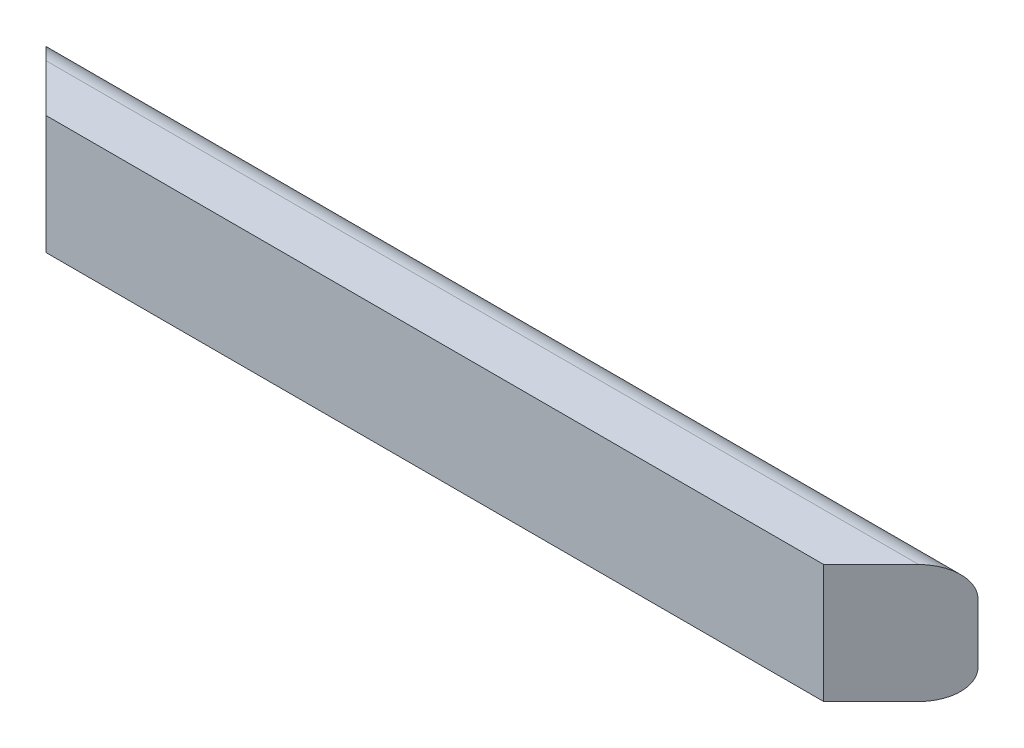
ISO-10303-21;
HEADER;
FILE_DESCRIPTION(('STEP AP214'),'2;1');
FILE_NAME('part.step','',(''),(''),'','','');
FILE_SCHEMA(('AUTOMOTIVE_DESIGN { 1 0 10303 214 1 1 1 1 }'));
ENDSEC;
DATA;
#1=APPLICATION_CONTEXT('core data for automotive mechanical design processes');
#2=APPLICATION_PROTOCOL_DEFINITION('international standard','automotive_design',2000,#1);
#3=PRODUCT_CONTEXT('',#1,'mechanical');
#4=PRODUCT('Part','Part','',(#3));
#5=PRODUCT_RELATED_PRODUCT_CATEGORY('part','',(#4));
#6=PRODUCT_DEFINITION_FORMATION('','',#4);
#7=PRODUCT_DEFINITION_CONTEXT('part definition',#1,'design');
#8=PRODUCT_DEFINITION('design','',#6,#7);
#9=PRODUCT_DEFINITION_SHAPE('','',#8);
#10=(LENGTH_UNIT() NAMED_UNIT(*) SI_UNIT(.MILLI.,.METRE.));
#11=(NAMED_UNIT(*) PLANE_ANGLE_UNIT() SI_UNIT($,.RADIAN.));
#12=(NAMED_UNIT(*) SI_UNIT($,.STERADIAN.) SOLID_ANGLE_UNIT());
#13=UNCERTAINTY_MEASURE_WITH_UNIT(LENGTH_MEASURE(1.E-05),#10,'distance_accuracy_value','');
#14=(GEOMETRIC_REPRESENTATION_CONTEXT(3) GLOBAL_UNCERTAINTY_ASSIGNED_CONTEXT((#13)) GLOBAL_UNIT_ASSIGNED_CONTEXT((#10,
#11,#12)) REPRESENTATION_CONTEXT('',''));
#15=CARTESIAN_POINT('',(0.,0.,0.));
#16=DIRECTION('',(0.,0.,1.));
#17=DIRECTION('',(1.,0.,0.));
#18=AXIS2_PLACEMENT_3D('',#15,#16,#17);
#19=CARTESIAN_POINT('',(996.95,0.,0.));
#20=DIRECTION('',(0.,1.,0.));
#21=DIRECTION('',(0.,0.,1.));
#22=AXIS2_PLACEMENT_3D('',#19,#20,#21);
#23=PLANE('',#22);
#24=DIRECTION('',(-1.,0.,0.));
#25=VECTOR('',#24,1.);
#26=CARTESIAN_POINT('',(996.95,0.,19.05));
#27=LINE('',#26,#25);
#28=CARTESIAN_POINT('',(914.4,0.,19.05));
#29=VERTEX_POINT('',#28);
#30=CARTESIAN_POINT('',(82.5499999999999,0.,19.05));
#31=VERTEX_POINT('',#30);
#32=EDGE_CURVE('E110',#29,#31,#27,.T.);
#33=ORIENTED_EDGE('',*,*,#32,.T.);
#34=DIRECTION('',(-0.707106781186549,0.,-0.707106781186546));
#35=VECTOR('',#34,1.);
#36=CARTESIAN_POINT('',(530.225000000001,0.,466.725));
#37=LINE('',#36,#35);
#38=CARTESIAN_POINT('',(31.7499999999996,0.,-31.7500000000001));
#39=VERTEX_POINT('',#38);
#40=EDGE_CURVE('E98',#31,#39,#37,.T.);
#41=ORIENTED_EDGE('',*,*,#40,.T.);
#42=DIRECTION('',(-1.,0.,0.));
#43=VECTOR('',#42,1.);
#44=CARTESIAN_POINT('',(996.95,0.,-31.75));
#45=LINE('',#44,#43);
#46=CARTESIAN_POINT('',(965.2,0.,-31.75));
#47=VERTEX_POINT('',#46);
#48=EDGE_CURVE('E11',#47,#39,#45,.T.);
#49=ORIENTED_EDGE('',*,*,#48,.F.);
#50=DIRECTION('',(-0.707106781186549,0.,0.707106781186546));
#51=VECTOR('',#50,1.);
#52=CARTESIAN_POINT('',(965.2,0.,-31.7499999999999));
#53=LINE('',#52,#51);
#54=EDGE_CURVE('E115',#47,#29,#53,.T.);
#55=ORIENTED_EDGE('',*,*,#54,.T.);
#56=EDGE_LOOP('',(#33,#41,#49,#55));
#57=FACE_BOUND('',#56,.T.);
#58=ADVANCED_FACE('F33',(#57),#23,.F.);
#59=CARTESIAN_POINT('',(996.95,31.75,-31.75));
#60=DIRECTION('',(-1.,0.,0.));
#61=DIRECTION('',(0.,0.,1.));
#62=AXIS2_PLACEMENT_3D('',#59,#60,#61);
#63=CYLINDRICAL_SURFACE('',#62,31.75);
#64=ORIENTED_EDGE('',*,*,#48,.T.);
#65=CARTESIAN_POINT('',(31.7499999999997,31.75,-31.75));
#66=DIRECTION('',(0.707106781186546,0.,-0.707106781186549));
#67=DIRECTION('',(-0.707106781186549,0.,-0.707106781186546));
#68=AXIS2_PLACEMENT_3D('',#65,#66,#67);
#69=ELLIPSE('',#68,44.9012806053458,31.75);
#70=CARTESIAN_POINT('',(0.,31.75,-63.4999999999996));
#71=VERTEX_POINT('',#70);
#72=EDGE_CURVE('E83',#39,#71,#69,.T.);
#73=ORIENTED_EDGE('',*,*,#72,.T.);
#74=DIRECTION('',(-1.,0.,0.));
#75=VECTOR('',#74,1.);
#76=CARTESIAN_POINT('',(996.95,31.75,-63.5));
#77=LINE('',#76,#75);
#78=CARTESIAN_POINT('',(996.95,31.75,-63.5));
#79=VERTEX_POINT('',#78);
#80=EDGE_CURVE('E41',#79,#71,#77,.T.);
#81=ORIENTED_EDGE('',*,*,#80,.F.);
#82=CARTESIAN_POINT('',(965.2,31.75,-31.75));
#83=DIRECTION('',(-0.707106781186546,0.,-0.707106781186549));
#84=DIRECTION('',(-0.707106781186549,0.,0.707106781186546));
#85=AXIS2_PLACEMENT_3D('',#82,#83,#84);
#86=ELLIPSE('',#85,44.9012806053458,31.75);
#87=EDGE_CURVE('E47',#79,#47,#86,.T.);
#88=ORIENTED_EDGE('',*,*,#87,.T.);
#89=EDGE_LOOP('',(#64,#73,#81,#88));
#90=FACE_BOUND('',#89,.T.);
#91=ADVANCED_FACE('F94',(#90),#63,.T.);
#92=CARTESIAN_POINT('',(996.95,95.25,-63.5));
#93=DIRECTION('',(0.,0.,1.));
#94=DIRECTION('',(1.,0.,0.));
#95=AXIS2_PLACEMENT_3D('',#92,#93,#94);
#96=PLANE('',#95);
#97=DIRECTION('',(0.,1.,0.));
#98=VECTOR('',#97,1.);
#99=CARTESIAN_POINT('',(0.,95.25,-63.5));
#100=LINE('',#99,#98);
#101=CARTESIAN_POINT('',(0.,95.25,-63.5));
#102=VERTEX_POINT('',#101);
#103=EDGE_CURVE('E80',#71,#102,#100,.T.);
#104=ORIENTED_EDGE('',*,*,#103,.T.);
#105=DIRECTION('',(-1.,0.,0.));
#106=VECTOR('',#105,1.);
#107=CARTESIAN_POINT('',(996.95,95.25,-63.5));
#108=LINE('',#107,#106);
#109=CARTESIAN_POINT('',(996.95,95.25,-63.4999999999996));
#110=VERTEX_POINT('',#109);
#111=EDGE_CURVE('E101',#110,#102,#108,.T.);
#112=ORIENTED_EDGE('',*,*,#111,.F.);
#113=DIRECTION('',(0.,1.,0.));
#114=VECTOR('',#113,1.);
#115=CARTESIAN_POINT('',(996.95,95.25,-63.5));
#116=LINE('',#115,#114);
#117=EDGE_CURVE('E91',#79,#110,#116,.T.);
#118=ORIENTED_EDGE('',*,*,#117,.F.);
#119=ORIENTED_EDGE('',*,*,#80,.T.);
#120=EDGE_LOOP('',(#104,#112,#118,#119));
#121=FACE_BOUND('',#120,.T.);
#122=ADVANCED_FACE('F100',(#121),#96,.F.);
#123=CARTESIAN_POINT('',(996.95,95.25,-31.75));
#124=DIRECTION('',(-1.,0.,0.));
#125=DIRECTION('',(0.,0.,1.));
#126=AXIS2_PLACEMENT_3D('',#123,#124,#125);
#127=CYLINDRICAL_SURFACE('',#126,31.75);
#128=ORIENTED_EDGE('',*,*,#111,.T.);
#129=CARTESIAN_POINT('',(31.7499999999997,95.25,-31.75));
#130=DIRECTION('',(0.707106781186546,0.,-0.707106781186549));
#131=DIRECTION('',(-0.707106781186549,0.,-0.707106781186546));
#132=AXIS2_PLACEMENT_3D('',#129,#130,#131);
#133=ELLIPSE('',#132,44.9012806053458,31.75);
#134=CARTESIAN_POINT('',(31.7499999999997,127.,-31.75));
#135=VERTEX_POINT('',#134);
#136=EDGE_CURVE('E86',#102,#135,#133,.T.);
#137=ORIENTED_EDGE('',*,*,#136,.T.);
#138=DIRECTION('',(-1.,0.,0.));
#139=VECTOR('',#138,1.);
#140=CARTESIAN_POINT('',(996.95,127.,-31.75));
#141=LINE('',#140,#139);
#142=CARTESIAN_POINT('',(965.2,127.,-31.75));
#143=VERTEX_POINT('',#142);
#144=EDGE_CURVE('E102',#143,#135,#141,.T.);
#145=ORIENTED_EDGE('',*,*,#144,.F.);
#146=CARTESIAN_POINT('',(965.2,95.25,-31.75));
#147=DIRECTION('',(-0.707106781186546,0.,-0.707106781186549));
#148=DIRECTION('',(-0.707106781186549,0.,0.707106781186546));
#149=AXIS2_PLACEMENT_3D('',#146,#147,#148);
#150=ELLIPSE('',#149,44.9012806053458,31.75);
#151=EDGE_CURVE('E97',#143,#110,#150,.T.);
#152=ORIENTED_EDGE('',*,*,#151,.T.);
#153=EDGE_LOOP('',(#128,#137,#145,#152));
#154=FACE_BOUND('',#153,.T.);
#155=ADVANCED_FACE('F135',(#154),#127,.T.);
#156=CARTESIAN_POINT('',(996.95,127.,19.05));
#157=DIRECTION('',(0.,-1.,0.));
#158=DIRECTION('',(0.,0.,-1.));
#159=AXIS2_PLACEMENT_3D('',#156,#157,#158);
#160=PLANE('',#159);
#161=ORIENTED_EDGE('',*,*,#144,.T.);
#162=DIRECTION('',(0.707106781186549,0.,0.707106781186546));
#163=VECTOR('',#162,1.);
#164=CARTESIAN_POINT('',(539.750000000001,127.000000000001,476.25));
#165=LINE('',#164,#163);
#166=CARTESIAN_POINT('',(82.5500000000001,127.,19.05));
#167=VERTEX_POINT('',#166);
#168=EDGE_CURVE('E130',#135,#167,#165,.T.);
#169=ORIENTED_EDGE('',*,*,#168,.T.);
#170=DIRECTION('',(-1.,0.,0.));
#171=VECTOR('',#170,1.);
#172=CARTESIAN_POINT('',(996.95,127.,19.05));
#173=LINE('',#172,#171);
#174=CARTESIAN_POINT('',(914.4,127.,19.05));
#175=VERTEX_POINT('',#174);
#176=EDGE_CURVE('E107',#175,#167,#173,.T.);
#177=ORIENTED_EDGE('',*,*,#176,.F.);
#178=DIRECTION('',(0.707106781186549,0.,-0.707106781186546));
#179=VECTOR('',#178,1.);
#180=CARTESIAN_POINT('',(955.675,127.,-22.2249999999999));
#181=LINE('',#180,#179);
#182=EDGE_CURVE('E121',#175,#143,#181,.T.);
#183=ORIENTED_EDGE('',*,*,#182,.T.);
#184=EDGE_LOOP('',(#161,#169,#177,#183));
#185=FACE_BOUND('',#184,.T.);
#186=ADVANCED_FACE('F137',(#185),#160,.F.);
#187=CARTESIAN_POINT('',(996.95,0.,19.05));
#188=DIRECTION('',(0.,0.,-1.));
#189=DIRECTION('',(-1.,0.,0.));
#190=AXIS2_PLACEMENT_3D('',#187,#188,#189);
#191=PLANE('',#190);
#192=ORIENTED_EDGE('',*,*,#176,.T.);
#193=DIRECTION('',(0.,-1.,0.));
#194=VECTOR('',#193,1.);
#195=CARTESIAN_POINT('',(82.5499999999999,0.,19.05));
#196=LINE('',#195,#194);
#197=EDGE_CURVE('E127',#167,#31,#196,.T.);
#198=ORIENTED_EDGE('',*,*,#197,.T.);
#199=ORIENTED_EDGE('',*,*,#32,.F.);
#200=DIRECTION('',(0.,1.,0.));
#201=VECTOR('',#200,1.);
#202=CARTESIAN_POINT('',(914.4,0.,19.05));
#203=LINE('',#202,#201);
#204=EDGE_CURVE('E118',#29,#175,#203,.T.);
#205=ORIENTED_EDGE('',*,*,#204,.T.);
#206=EDGE_LOOP('',(#192,#198,#199,#205));
#207=FACE_BOUND('',#206,.T.);
#208=ADVANCED_FACE('F142',(#207),#191,.F.);
#209=CARTESIAN_POINT('',(466.724999999999,0.,466.725));
#210=DIRECTION('',(-0.707106781186546,0.,-0.707106781186549));
#211=DIRECTION('',(-0.707106781186549,0.,0.707106781186546));
#212=AXIS2_PLACEMENT_3D('',#209,#210,#211);
#213=PLANE('',#212);
#214=ORIENTED_EDGE('',*,*,#117,.T.);
#215=ORIENTED_EDGE('',*,*,#151,.F.);
#216=ORIENTED_EDGE('',*,*,#182,.F.);
#217=ORIENTED_EDGE('',*,*,#204,.F.);
#218=ORIENTED_EDGE('',*,*,#54,.F.);
#219=ORIENTED_EDGE('',*,*,#87,.F.);
#220=EDGE_LOOP('',(#214,#215,#216,#217,#218,#219));
#221=FACE_BOUND('',#220,.T.);
#222=ADVANCED_FACE('F139',(#221),#213,.F.);
#223=CARTESIAN_POINT('',(530.225000000001,0.,466.725));
#224=DIRECTION('',(0.707106781186546,0.,-0.707106781186549));
#225=DIRECTION('',(0.707106781186549,0.,0.707106781186546));
#226=AXIS2_PLACEMENT_3D('',#223,#224,#225);
#227=PLANE('',#226);
#228=ORIENTED_EDGE('',*,*,#40,.F.);
#229=ORIENTED_EDGE('',*,*,#197,.F.);
#230=ORIENTED_EDGE('',*,*,#168,.F.);
#231=ORIENTED_EDGE('',*,*,#136,.F.);
#232=ORIENTED_EDGE('',*,*,#103,.F.);
#233=ORIENTED_EDGE('',*,*,#72,.F.);
#234=EDGE_LOOP('',(#228,#229,#230,#231,#232,#233));
#235=FACE_BOUND('',#234,.T.);
#236=ADVANCED_FACE('F82',(#235),#227,.F.);
#237=CLOSED_SHELL('',(#58,#91,#122,#155,#186,#208,#222,#236));
#238=MANIFOLD_SOLID_BREP('B2',#237);
#239=ADVANCED_BREP_SHAPE_REPRESENTATION('',(#18,#238),#14);
#240=SHAPE_DEFINITION_REPRESENTATION(#9,#239);
ENDSEC;
END-ISO-10303-21;
